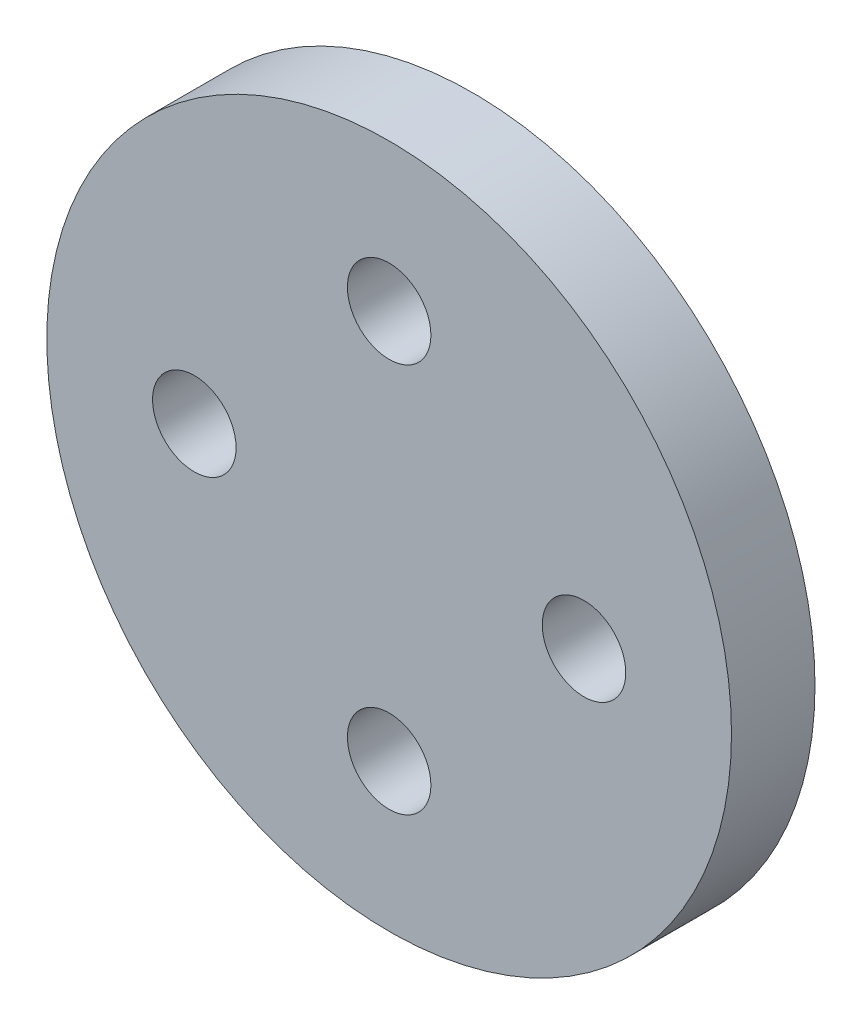
ISO-10303-21;
HEADER;
FILE_DESCRIPTION(('STEP AP214'),'2;1');
FILE_NAME('part.step','',(''),(''),'','','');
FILE_SCHEMA(('AUTOMOTIVE_DESIGN { 1 0 10303 214 1 1 1 1 }'));
ENDSEC;
DATA;
#1=APPLICATION_CONTEXT('core data for automotive mechanical design processes');
#2=APPLICATION_PROTOCOL_DEFINITION('international standard','automotive_design',2000,#1);
#3=PRODUCT_CONTEXT('',#1,'mechanical');
#4=PRODUCT('Part','Part','',(#3));
#5=PRODUCT_RELATED_PRODUCT_CATEGORY('part','',(#4));
#6=PRODUCT_DEFINITION_FORMATION('','',#4);
#7=PRODUCT_DEFINITION_CONTEXT('part definition',#1,'design');
#8=PRODUCT_DEFINITION('design','',#6,#7);
#9=PRODUCT_DEFINITION_SHAPE('','',#8);
#10=(LENGTH_UNIT() NAMED_UNIT(*) SI_UNIT(.MILLI.,.METRE.));
#11=(NAMED_UNIT(*) PLANE_ANGLE_UNIT() SI_UNIT($,.RADIAN.));
#12=(NAMED_UNIT(*) SI_UNIT($,.STERADIAN.) SOLID_ANGLE_UNIT());
#13=UNCERTAINTY_MEASURE_WITH_UNIT(LENGTH_MEASURE(1.E-05),#10,'distance_accuracy_value','');
#14=(GEOMETRIC_REPRESENTATION_CONTEXT(3) GLOBAL_UNCERTAINTY_ASSIGNED_CONTEXT((#13)) GLOBAL_UNIT_ASSIGNED_CONTEXT((#10,
#11,#12)) REPRESENTATION_CONTEXT('',''));
#15=CARTESIAN_POINT('',(0.,0.,0.));
#16=DIRECTION('',(0.,0.,1.));
#17=DIRECTION('',(1.,0.,0.));
#18=AXIS2_PLACEMENT_3D('',#15,#16,#17);
#19=CARTESIAN_POINT('',(0.,0.,3.));
#20=DIRECTION('',(0.,0.,1.));
#21=DIRECTION('',(1.,0.,0.));
#22=AXIS2_PLACEMENT_3D('',#19,#20,#21);
#23=PLANE('',#22);
#24=CARTESIAN_POINT('',(0.,-7.,3.));
#25=DIRECTION('',(0.,0.,1.));
#26=DIRECTION('',(1.,0.,0.));
#27=AXIS2_PLACEMENT_3D('',#24,#25,#26);
#28=CIRCLE('',#27,1.5);
#29=CARTESIAN_POINT('',(1.49999999999993,-7.,3.));
#30=VERTEX_POINT('',#29);
#31=EDGE_CURVE('E56',#30,#30,#28,.T.);
#32=ORIENTED_EDGE('',*,*,#31,.F.);
#33=EDGE_LOOP('',(#32));
#34=FACE_BOUND('',#33,.T.);
#35=CARTESIAN_POINT('',(0.,7.,3.));
#36=DIRECTION('',(0.,0.,1.));
#37=DIRECTION('',(1.,0.,0.));
#38=AXIS2_PLACEMENT_3D('',#35,#36,#37);
#39=CIRCLE('',#38,1.5);
#40=CARTESIAN_POINT('',(1.50000000000002,7.,3.));
#41=VERTEX_POINT('',#40);
#42=EDGE_CURVE('E68',#41,#41,#39,.T.);
#43=ORIENTED_EDGE('',*,*,#42,.F.);
#44=EDGE_LOOP('',(#43));
#45=FACE_BOUND('',#44,.T.);
#46=CARTESIAN_POINT('',(0.,0.,3.));
#47=DIRECTION('',(0.,0.,1.));
#48=DIRECTION('',(1.,0.,0.));
#49=AXIS2_PLACEMENT_3D('',#46,#47,#48);
#50=CIRCLE('',#49,12.3);
#51=CARTESIAN_POINT('',(12.3,0.,3.));
#52=VERTEX_POINT('',#51);
#53=EDGE_CURVE('E41',#52,#52,#50,.T.);
#54=ORIENTED_EDGE('',*,*,#53,.T.);
#55=EDGE_LOOP('',(#54));
#56=FACE_BOUND('',#55,.T.);
#57=CARTESIAN_POINT('',(7.,0.,3.));
#58=DIRECTION('',(0.,0.,1.));
#59=DIRECTION('',(1.,0.,0.));
#60=AXIS2_PLACEMENT_3D('',#57,#58,#59);
#61=CIRCLE('',#60,1.5);
#62=CARTESIAN_POINT('',(8.5,0.,3.));
#63=VERTEX_POINT('',#62);
#64=EDGE_CURVE('E62',#63,#63,#61,.T.);
#65=ORIENTED_EDGE('',*,*,#64,.F.);
#66=EDGE_LOOP('',(#65));
#67=FACE_BOUND('',#66,.T.);
#68=CARTESIAN_POINT('',(-7.,0.,3.));
#69=DIRECTION('',(0.,0.,1.));
#70=DIRECTION('',(1.,0.,0.));
#71=AXIS2_PLACEMENT_3D('',#68,#69,#70);
#72=CIRCLE('',#71,1.5);
#73=CARTESIAN_POINT('',(-5.5,0.,3.));
#74=VERTEX_POINT('',#73);
#75=EDGE_CURVE('E49',#74,#74,#72,.T.);
#76=ORIENTED_EDGE('',*,*,#75,.F.);
#77=EDGE_LOOP('',(#76));
#78=FACE_BOUND('',#77,.T.);
#79=ADVANCED_FACE('F33',(#34,#45,#56,#67,#78),#23,.T.);
#80=CARTESIAN_POINT('',(0.,0.,0.));
#81=DIRECTION('',(0.,0.,1.));
#82=DIRECTION('',(1.,0.,0.));
#83=AXIS2_PLACEMENT_3D('',#80,#81,#82);
#84=PLANE('',#83);
#85=CARTESIAN_POINT('',(0.,0.,0.));
#86=DIRECTION('',(0.,0.,-1.));
#87=DIRECTION('',(-1.,0.,0.));
#88=AXIS2_PLACEMENT_3D('',#85,#86,#87);
#89=CIRCLE('',#88,3.);
#90=CARTESIAN_POINT('',(-3.,0.,0.));
#91=VERTEX_POINT('',#90);
#92=EDGE_CURVE('E10',#91,#91,#89,.T.);
#93=ORIENTED_EDGE('',*,*,#92,.F.);
#94=EDGE_LOOP('',(#93));
#95=FACE_BOUND('',#94,.T.);
#96=CARTESIAN_POINT('',(0.,0.,0.));
#97=DIRECTION('',(0.,0.,1.));
#98=DIRECTION('',(1.,0.,0.));
#99=AXIS2_PLACEMENT_3D('',#96,#97,#98);
#100=CIRCLE('',#99,12.3);
#101=CARTESIAN_POINT('',(12.3,0.,0.));
#102=VERTEX_POINT('',#101);
#103=EDGE_CURVE('E37',#102,#102,#100,.T.);
#104=ORIENTED_EDGE('',*,*,#103,.F.);
#105=EDGE_LOOP('',(#104));
#106=FACE_BOUND('',#105,.T.);
#107=CARTESIAN_POINT('',(0.,7.,0.));
#108=DIRECTION('',(0.,0.,1.));
#109=DIRECTION('',(1.,0.,0.));
#110=AXIS2_PLACEMENT_3D('',#107,#108,#109);
#111=CIRCLE('',#110,1.5);
#112=CARTESIAN_POINT('',(1.50000000000002,7.,0.));
#113=VERTEX_POINT('',#112);
#114=EDGE_CURVE('E65',#113,#113,#111,.T.);
#115=ORIENTED_EDGE('',*,*,#114,.T.);
#116=EDGE_LOOP('',(#115));
#117=FACE_BOUND('',#116,.T.);
#118=CARTESIAN_POINT('',(7.,0.,0.));
#119=DIRECTION('',(0.,0.,1.));
#120=DIRECTION('',(1.,0.,0.));
#121=AXIS2_PLACEMENT_3D('',#118,#119,#120);
#122=CIRCLE('',#121,1.5);
#123=CARTESIAN_POINT('',(8.5,0.,0.));
#124=VERTEX_POINT('',#123);
#125=EDGE_CURVE('E59',#124,#124,#122,.T.);
#126=ORIENTED_EDGE('',*,*,#125,.T.);
#127=EDGE_LOOP('',(#126));
#128=FACE_BOUND('',#127,.T.);
#129=CARTESIAN_POINT('',(0.,-7.,0.));
#130=DIRECTION('',(0.,0.,1.));
#131=DIRECTION('',(1.,0.,0.));
#132=AXIS2_PLACEMENT_3D('',#129,#130,#131);
#133=CIRCLE('',#132,1.5);
#134=CARTESIAN_POINT('',(1.49999999999993,-7.,0.));
#135=VERTEX_POINT('',#134);
#136=EDGE_CURVE('E52',#135,#135,#133,.T.);
#137=ORIENTED_EDGE('',*,*,#136,.T.);
#138=EDGE_LOOP('',(#137));
#139=FACE_BOUND('',#138,.T.);
#140=CARTESIAN_POINT('',(-7.,0.,0.));
#141=DIRECTION('',(0.,0.,1.));
#142=DIRECTION('',(1.,0.,0.));
#143=AXIS2_PLACEMENT_3D('',#140,#141,#142);
#144=CIRCLE('',#143,1.5);
#145=CARTESIAN_POINT('',(-5.5,0.,0.));
#146=VERTEX_POINT('',#145);
#147=EDGE_CURVE('E53',#146,#146,#144,.T.);
#148=ORIENTED_EDGE('',*,*,#147,.T.);
#149=EDGE_LOOP('',(#148));
#150=FACE_BOUND('',#149,.T.);
#151=ADVANCED_FACE('F74',(#95,#106,#117,#128,#139,#150),#84,.F.);
#152=CARTESIAN_POINT('',(0.,0.,3.));
#153=DIRECTION('',(0.,0.,-1.));
#154=DIRECTION('',(-1.,0.,0.));
#155=AXIS2_PLACEMENT_3D('',#152,#153,#154);
#156=CYLINDRICAL_SURFACE('',#155,12.3);
#157=ORIENTED_EDGE('',*,*,#53,.F.);
#158=EDGE_LOOP('',(#157));
#159=FACE_BOUND('',#158,.T.);
#160=ORIENTED_EDGE('',*,*,#103,.T.);
#161=EDGE_LOOP('',(#160));
#162=FACE_BOUND('',#161,.T.);
#163=ADVANCED_FACE('F35',(#159,#162),#156,.T.);
#164=CARTESIAN_POINT('',(0.,7.,3.));
#165=DIRECTION('',(0.,0.,-1.));
#166=DIRECTION('',(-1.,0.,0.));
#167=AXIS2_PLACEMENT_3D('',#164,#165,#166);
#168=CYLINDRICAL_SURFACE('',#167,1.5);
#169=ORIENTED_EDGE('',*,*,#42,.T.);
#170=EDGE_LOOP('',(#169));
#171=FACE_BOUND('',#170,.T.);
#172=ORIENTED_EDGE('',*,*,#114,.F.);
#173=EDGE_LOOP('',(#172));
#174=FACE_BOUND('',#173,.T.);
#175=ADVANCED_FACE('F77',(#171,#174),#168,.F.);
#176=CARTESIAN_POINT('',(7.,0.,3.));
#177=DIRECTION('',(0.,0.,-1.));
#178=DIRECTION('',(-1.,0.,0.));
#179=AXIS2_PLACEMENT_3D('',#176,#177,#178);
#180=CYLINDRICAL_SURFACE('',#179,1.5);
#181=ORIENTED_EDGE('',*,*,#64,.T.);
#182=EDGE_LOOP('',(#181));
#183=FACE_BOUND('',#182,.T.);
#184=ORIENTED_EDGE('',*,*,#125,.F.);
#185=EDGE_LOOP('',(#184));
#186=FACE_BOUND('',#185,.T.);
#187=ADVANCED_FACE('F79',(#183,#186),#180,.F.);
#188=CARTESIAN_POINT('',(0.,-7.,3.));
#189=DIRECTION('',(0.,0.,-1.));
#190=DIRECTION('',(-1.,0.,0.));
#191=AXIS2_PLACEMENT_3D('',#188,#189,#190);
#192=CYLINDRICAL_SURFACE('',#191,1.5);
#193=ORIENTED_EDGE('',*,*,#31,.T.);
#194=EDGE_LOOP('',(#193));
#195=FACE_BOUND('',#194,.T.);
#196=ORIENTED_EDGE('',*,*,#136,.F.);
#197=EDGE_LOOP('',(#196));
#198=FACE_BOUND('',#197,.T.);
#199=ADVANCED_FACE('F86',(#195,#198),#192,.F.);
#200=CARTESIAN_POINT('',(-7.,0.,3.));
#201=DIRECTION('',(0.,0.,-1.));
#202=DIRECTION('',(-1.,0.,0.));
#203=AXIS2_PLACEMENT_3D('',#200,#201,#202);
#204=CYLINDRICAL_SURFACE('',#203,1.5);
#205=ORIENTED_EDGE('',*,*,#75,.T.);
#206=EDGE_LOOP('',(#205));
#207=FACE_BOUND('',#206,.T.);
#208=ORIENTED_EDGE('',*,*,#147,.F.);
#209=EDGE_LOOP('',(#208));
#210=FACE_BOUND('',#209,.T.);
#211=ADVANCED_FACE('F107',(#207,#210),#204,.F.);
#212=CARTESIAN_POINT('',(0.,0.,-3.));
#213=DIRECTION('',(0.,0.,1.));
#214=DIRECTION('',(1.,0.,0.));
#215=AXIS2_PLACEMENT_3D('',#212,#213,#214);
#216=CYLINDRICAL_SURFACE('',#215,3.);
#217=CARTESIAN_POINT('',(0.,0.,-3.));
#218=DIRECTION('',(0.,0.,-1.));
#219=DIRECTION('',(-1.,0.,0.));
#220=AXIS2_PLACEMENT_3D('',#217,#218,#219);
#221=CIRCLE('',#220,3.);
#222=CARTESIAN_POINT('',(-3.,0.,-3.));
#223=VERTEX_POINT('',#222);
#224=EDGE_CURVE('E48',#223,#223,#221,.T.);
#225=ORIENTED_EDGE('',*,*,#224,.F.);
#226=EDGE_LOOP('',(#225));
#227=FACE_BOUND('',#226,.T.);
#228=ORIENTED_EDGE('',*,*,#92,.T.);
#229=EDGE_LOOP('',(#228));
#230=FACE_BOUND('',#229,.T.);
#231=ADVANCED_FACE('F110',(#227,#230),#216,.T.);
#232=CARTESIAN_POINT('',(0.,0.,-3.));
#233=DIRECTION('',(0.,0.,-1.));
#234=DIRECTION('',(-1.,0.,0.));
#235=AXIS2_PLACEMENT_3D('',#232,#233,#234);
#236=PLANE('',#235);
#237=ORIENTED_EDGE('',*,*,#224,.T.);
#238=EDGE_LOOP('',(#237));
#239=FACE_BOUND('',#238,.T.);
#240=ADVANCED_FACE('F118',(#239),#236,.T.);
#241=CLOSED_SHELL('',(#79,#151,#163,#175,#187,#199,#211,#231,#240));
#242=MANIFOLD_SOLID_BREP('B2',#241);
#243=ADVANCED_BREP_SHAPE_REPRESENTATION('',(#18,#242),#14);
#244=SHAPE_DEFINITION_REPRESENTATION(#9,#243);
ENDSEC;
END-ISO-10303-21;
